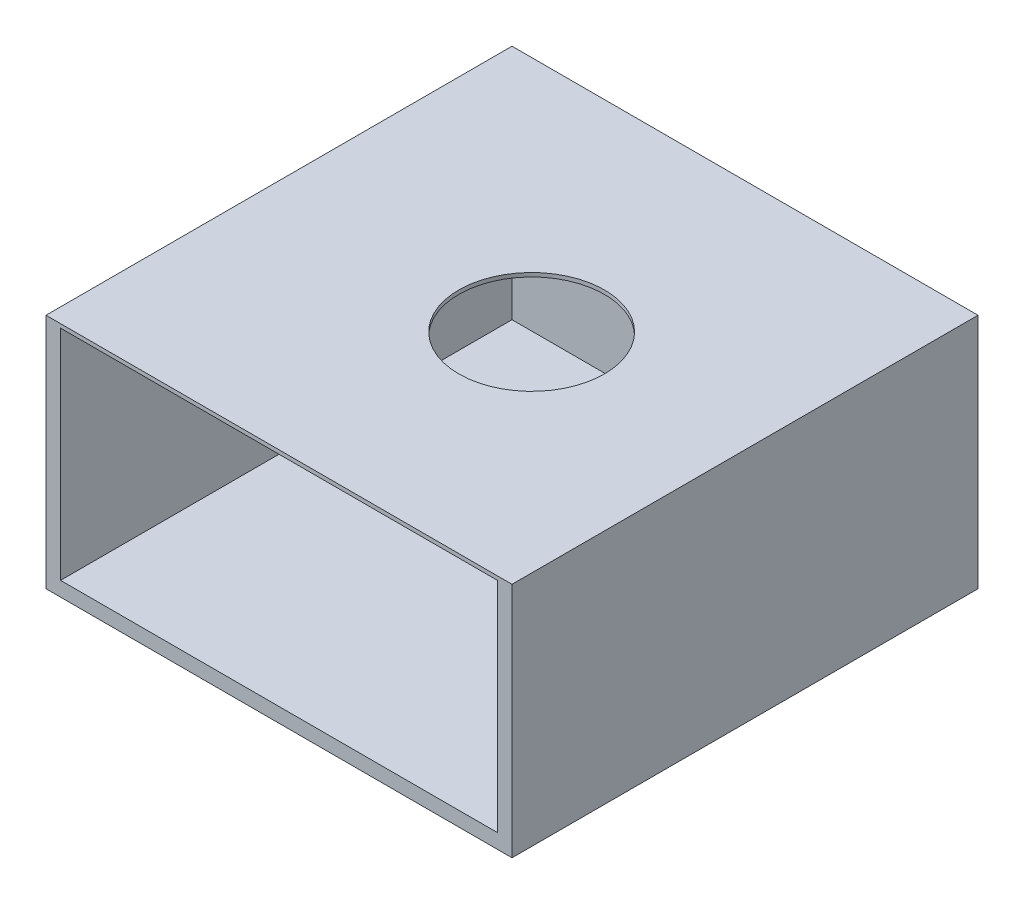
ISO-10303-21;
HEADER;
FILE_DESCRIPTION(('STEP AP214'),'2;1');
FILE_NAME('part.step','',(''),(''),'','','');
FILE_SCHEMA(('AUTOMOTIVE_DESIGN { 1 0 10303 214 1 1 1 1 }'));
ENDSEC;
DATA;
#1=APPLICATION_CONTEXT('core data for automotive mechanical design processes');
#2=APPLICATION_PROTOCOL_DEFINITION('international standard','automotive_design',2000,#1);
#3=PRODUCT_CONTEXT('',#1,'mechanical');
#4=PRODUCT('Part','Part','',(#3));
#5=PRODUCT_RELATED_PRODUCT_CATEGORY('part','',(#4));
#6=PRODUCT_DEFINITION_FORMATION('','',#4);
#7=PRODUCT_DEFINITION_CONTEXT('part definition',#1,'design');
#8=PRODUCT_DEFINITION('design','',#6,#7);
#9=PRODUCT_DEFINITION_SHAPE('','',#8);
#10=(LENGTH_UNIT() NAMED_UNIT(*) SI_UNIT(.MILLI.,.METRE.));
#11=(NAMED_UNIT(*) PLANE_ANGLE_UNIT() SI_UNIT($,.RADIAN.));
#12=(NAMED_UNIT(*) SI_UNIT($,.STERADIAN.) SOLID_ANGLE_UNIT());
#13=UNCERTAINTY_MEASURE_WITH_UNIT(LENGTH_MEASURE(1.E-05),#10,'distance_accuracy_value','');
#14=(GEOMETRIC_REPRESENTATION_CONTEXT(3) GLOBAL_UNCERTAINTY_ASSIGNED_CONTEXT((#13)) GLOBAL_UNIT_ASSIGNED_CONTEXT((#10,
#11,#12)) REPRESENTATION_CONTEXT('',''));
#15=CARTESIAN_POINT('',(0.,0.,0.));
#16=DIRECTION('',(0.,0.,1.));
#17=DIRECTION('',(1.,0.,0.));
#18=AXIS2_PLACEMENT_3D('',#15,#16,#17);
#19=CARTESIAN_POINT('',(0.,0.,304.8));
#20=DIRECTION('',(0.,0.,-1.));
#21=DIRECTION('',(-1.,0.,0.));
#22=AXIS2_PLACEMENT_3D('',#19,#20,#21);
#23=PLANE('',#22);
#24=DIRECTION('',(1.,0.,0.));
#25=VECTOR('',#24,1.);
#26=CARTESIAN_POINT('',(-152.4,78.74,304.8));
#27=LINE('',#26,#25);
#28=CARTESIAN_POINT('',(-152.4,78.74,304.8));
#29=VERTEX_POINT('',#28);
#30=CARTESIAN_POINT('',(152.4,78.74,304.8));
#31=VERTEX_POINT('',#30);
#32=EDGE_CURVE('E168',#29,#31,#27,.T.);
#33=ORIENTED_EDGE('',*,*,#32,.F.);
#34=DIRECTION('',(0.,-1.,0.));
#35=VECTOR('',#34,1.);
#36=CARTESIAN_POINT('',(-152.4,-76.2,304.8));
#37=LINE('',#36,#35);
#38=CARTESIAN_POINT('',(-152.4,-76.2,304.8));
#39=VERTEX_POINT('',#38);
#40=EDGE_CURVE('E117',#29,#39,#37,.T.);
#41=ORIENTED_EDGE('',*,*,#40,.T.);
#42=DIRECTION('',(1.,0.,0.));
#43=VECTOR('',#42,1.);
#44=CARTESIAN_POINT('',(-152.4,-76.2,304.8));
#45=LINE('',#44,#43);
#46=CARTESIAN_POINT('',(152.4,-76.2,304.8));
#47=VERTEX_POINT('',#46);
#48=EDGE_CURVE('E70',#39,#47,#45,.T.);
#49=ORIENTED_EDGE('',*,*,#48,.T.);
#50=DIRECTION('',(0.,1.,0.));
#51=VECTOR('',#50,1.);
#52=CARTESIAN_POINT('',(152.4,-76.2,304.8));
#53=LINE('',#52,#51);
#54=EDGE_CURVE('E91',#47,#31,#53,.T.);
#55=ORIENTED_EDGE('',*,*,#54,.T.);
#56=EDGE_LOOP('',(#33,#41,#49,#55));
#57=FACE_BOUND('',#56,.T.);
#58=DIRECTION('',(0.,1.,0.));
#59=VECTOR('',#58,1.);
#60=CARTESIAN_POINT('',(142.875,0.,304.8));
#61=LINE('',#60,#59);
#62=CARTESIAN_POINT('',(142.875,-66.675,304.8));
#63=VERTEX_POINT('',#62);
#64=CARTESIAN_POINT('',(142.875,76.2,304.8));
#65=VERTEX_POINT('',#64);
#66=EDGE_CURVE('E122',#63,#65,#61,.T.);
#67=ORIENTED_EDGE('',*,*,#66,.F.);
#68=DIRECTION('',(1.,0.,0.));
#69=VECTOR('',#68,1.);
#70=CARTESIAN_POINT('',(0.,-66.675,304.8));
#71=LINE('',#70,#69);
#72=CARTESIAN_POINT('',(-142.875,-66.675,304.8));
#73=VERTEX_POINT('',#72);
#74=EDGE_CURVE('E128',#73,#63,#71,.T.);
#75=ORIENTED_EDGE('',*,*,#74,.F.);
#76=DIRECTION('',(0.,-1.,0.));
#77=VECTOR('',#76,1.);
#78=CARTESIAN_POINT('',(-142.875,0.,304.8));
#79=LINE('',#78,#77);
#80=CARTESIAN_POINT('',(-142.875,76.2,304.8));
#81=VERTEX_POINT('',#80);
#82=EDGE_CURVE('E126',#81,#73,#79,.T.);
#83=ORIENTED_EDGE('',*,*,#82,.F.);
#84=DIRECTION('',(1.,0.,0.));
#85=VECTOR('',#84,1.);
#86=CARTESIAN_POINT('',(142.875,76.2,304.8));
#87=LINE('',#86,#85);
#88=EDGE_CURVE('E157',#81,#65,#87,.T.);
#89=ORIENTED_EDGE('',*,*,#88,.T.);
#90=EDGE_LOOP('',(#67,#75,#83,#89));
#91=FACE_BOUND('',#90,.T.);
#92=ADVANCED_FACE('F45',(#57,#91),#23,.F.);
#93=CARTESIAN_POINT('',(152.4,-76.2,304.8));
#94=DIRECTION('',(-1.,0.,0.));
#95=DIRECTION('',(0.,0.,1.));
#96=AXIS2_PLACEMENT_3D('',#93,#94,#95);
#97=PLANE('',#96);
#98=DIRECTION('',(0.,1.,0.));
#99=VECTOR('',#98,1.);
#100=CARTESIAN_POINT('',(152.4,-76.2,0.));
#101=LINE('',#100,#99);
#102=CARTESIAN_POINT('',(152.4,-76.2,0.));
#103=VERTEX_POINT('',#102);
#104=CARTESIAN_POINT('',(152.4,78.74,0.));
#105=VERTEX_POINT('',#104);
#106=EDGE_CURVE('E98',#103,#105,#101,.T.);
#107=ORIENTED_EDGE('',*,*,#106,.T.);
#108=DIRECTION('',(0.,0.,-1.));
#109=VECTOR('',#108,1.);
#110=CARTESIAN_POINT('',(152.4,78.74,304.8));
#111=LINE('',#110,#109);
#112=EDGE_CURVE('E165',#31,#105,#111,.T.);
#113=ORIENTED_EDGE('',*,*,#112,.F.);
#114=ORIENTED_EDGE('',*,*,#54,.F.);
#115=DIRECTION('',(0.,0.,-1.));
#116=VECTOR('',#115,1.);
#117=CARTESIAN_POINT('',(152.4,-76.2,304.8));
#118=LINE('',#117,#116);
#119=EDGE_CURVE('E54',#47,#103,#118,.T.);
#120=ORIENTED_EDGE('',*,*,#119,.T.);
#121=EDGE_LOOP('',(#107,#113,#114,#120));
#122=FACE_BOUND('',#121,.T.);
#123=ADVANCED_FACE('F47',(#122),#97,.F.);
#124=CARTESIAN_POINT('',(-152.4,-76.2,304.8));
#125=DIRECTION('',(1.,0.,0.));
#126=DIRECTION('',(0.,0.,-1.));
#127=AXIS2_PLACEMENT_3D('',#124,#125,#126);
#128=PLANE('',#127);
#129=DIRECTION('',(0.,-1.,0.));
#130=VECTOR('',#129,1.);
#131=CARTESIAN_POINT('',(-152.4,-76.2,0.));
#132=LINE('',#131,#130);
#133=CARTESIAN_POINT('',(-152.4,78.74,0.));
#134=VERTEX_POINT('',#133);
#135=CARTESIAN_POINT('',(-152.4,-76.2,0.));
#136=VERTEX_POINT('',#135);
#137=EDGE_CURVE('E92',#134,#136,#132,.T.);
#138=ORIENTED_EDGE('',*,*,#137,.T.);
#139=DIRECTION('',(0.,0.,-1.));
#140=VECTOR('',#139,1.);
#141=CARTESIAN_POINT('',(-152.4,-76.2,304.8));
#142=LINE('',#141,#140);
#143=EDGE_CURVE('E11',#39,#136,#142,.T.);
#144=ORIENTED_EDGE('',*,*,#143,.F.);
#145=ORIENTED_EDGE('',*,*,#40,.F.);
#146=DIRECTION('',(0.,0.,1.));
#147=VECTOR('',#146,1.);
#148=CARTESIAN_POINT('',(-152.4,78.74,0.));
#149=LINE('',#148,#147);
#150=EDGE_CURVE('E161',#134,#29,#149,.T.);
#151=ORIENTED_EDGE('',*,*,#150,.F.);
#152=EDGE_LOOP('',(#138,#144,#145,#151));
#153=FACE_BOUND('',#152,.T.);
#154=ADVANCED_FACE('F199',(#153),#128,.F.);
#155=CARTESIAN_POINT('',(-152.4,-76.2,304.8));
#156=DIRECTION('',(0.,1.,0.));
#157=DIRECTION('',(0.,0.,1.));
#158=AXIS2_PLACEMENT_3D('',#155,#156,#157);
#159=PLANE('',#158);
#160=DIRECTION('',(1.,0.,0.));
#161=VECTOR('',#160,1.);
#162=CARTESIAN_POINT('',(-152.4,-76.2,0.));
#163=LINE('',#162,#161);
#164=EDGE_CURVE('E82',#136,#103,#163,.T.);
#165=ORIENTED_EDGE('',*,*,#164,.T.);
#166=ORIENTED_EDGE('',*,*,#119,.F.);
#167=ORIENTED_EDGE('',*,*,#48,.F.);
#168=ORIENTED_EDGE('',*,*,#143,.T.);
#169=EDGE_LOOP('',(#165,#166,#167,#168));
#170=FACE_BOUND('',#169,.T.);
#171=ADVANCED_FACE('F84',(#170),#159,.F.);
#172=CARTESIAN_POINT('',(0.,0.,0.));
#173=DIRECTION('',(0.,0.,-1.));
#174=DIRECTION('',(-1.,0.,0.));
#175=AXIS2_PLACEMENT_3D('',#172,#173,#174);
#176=PLANE('',#175);
#177=ORIENTED_EDGE('',*,*,#106,.F.);
#178=ORIENTED_EDGE('',*,*,#164,.F.);
#179=ORIENTED_EDGE('',*,*,#137,.F.);
#180=DIRECTION('',(-1.,0.,0.));
#181=VECTOR('',#180,1.);
#182=CARTESIAN_POINT('',(152.4,78.74,0.));
#183=LINE('',#182,#181);
#184=EDGE_CURVE('E104',#105,#134,#183,.T.);
#185=ORIENTED_EDGE('',*,*,#184,.F.);
#186=EDGE_LOOP('',(#177,#178,#179,#185));
#187=FACE_BOUND('',#186,.T.);
#188=ADVANCED_FACE('F102',(#187),#176,.T.);
#189=CARTESIAN_POINT('',(142.875,-76.2,304.8));
#190=DIRECTION('',(-1.,0.,0.));
#191=DIRECTION('',(0.,0.,1.));
#192=AXIS2_PLACEMENT_3D('',#189,#190,#191);
#193=PLANE('',#192);
#194=DIRECTION('',(0.,1.,0.));
#195=VECTOR('',#194,1.);
#196=CARTESIAN_POINT('',(142.875,0.,9.525));
#197=LINE('',#196,#195);
#198=CARTESIAN_POINT('',(142.875,-66.675,9.525));
#199=VERTEX_POINT('',#198);
#200=CARTESIAN_POINT('',(142.875,76.2,9.525));
#201=VERTEX_POINT('',#200);
#202=EDGE_CURVE('E141',#199,#201,#197,.T.);
#203=ORIENTED_EDGE('',*,*,#202,.F.);
#204=DIRECTION('',(0.,0.,-1.));
#205=VECTOR('',#204,1.);
#206=CARTESIAN_POINT('',(142.875,-66.675,304.8));
#207=LINE('',#206,#205);
#208=EDGE_CURVE('E131',#63,#199,#207,.T.);
#209=ORIENTED_EDGE('',*,*,#208,.F.);
#210=ORIENTED_EDGE('',*,*,#66,.T.);
#211=DIRECTION('',(0.,0.,-1.));
#212=VECTOR('',#211,1.);
#213=CARTESIAN_POINT('',(142.875,76.2,304.8));
#214=LINE('',#213,#212);
#215=EDGE_CURVE('E106',#65,#201,#214,.T.);
#216=ORIENTED_EDGE('',*,*,#215,.T.);
#217=EDGE_LOOP('',(#203,#209,#210,#216));
#218=FACE_BOUND('',#217,.T.);
#219=ADVANCED_FACE('F226',(#218),#193,.T.);
#220=CARTESIAN_POINT('',(-142.875,-76.2,304.8));
#221=DIRECTION('',(1.,0.,0.));
#222=DIRECTION('',(0.,0.,-1.));
#223=AXIS2_PLACEMENT_3D('',#220,#221,#222);
#224=PLANE('',#223);
#225=DIRECTION('',(0.,-1.,0.));
#226=VECTOR('',#225,1.);
#227=CARTESIAN_POINT('',(-142.875,0.,9.525));
#228=LINE('',#227,#226);
#229=CARTESIAN_POINT('',(-142.875,76.2,9.525));
#230=VERTEX_POINT('',#229);
#231=CARTESIAN_POINT('',(-142.875,-66.675,9.525));
#232=VERTEX_POINT('',#231);
#233=EDGE_CURVE('E140',#230,#232,#228,.T.);
#234=ORIENTED_EDGE('',*,*,#233,.F.);
#235=DIRECTION('',(0.,0.,-1.));
#236=VECTOR('',#235,1.);
#237=CARTESIAN_POINT('',(-142.875,76.2,304.8));
#238=LINE('',#237,#236);
#239=EDGE_CURVE('E112',#81,#230,#238,.T.);
#240=ORIENTED_EDGE('',*,*,#239,.F.);
#241=ORIENTED_EDGE('',*,*,#82,.T.);
#242=DIRECTION('',(0.,0.,-1.));
#243=VECTOR('',#242,1.);
#244=CARTESIAN_POINT('',(-142.875,-66.675,304.8));
#245=LINE('',#244,#243);
#246=EDGE_CURVE('E61',#73,#232,#245,.T.);
#247=ORIENTED_EDGE('',*,*,#246,.T.);
#248=EDGE_LOOP('',(#234,#240,#241,#247));
#249=FACE_BOUND('',#248,.T.);
#250=ADVANCED_FACE('F231',(#249),#224,.T.);
#251=CARTESIAN_POINT('',(-152.4,-66.675,304.8));
#252=DIRECTION('',(0.,1.,0.));
#253=DIRECTION('',(0.,0.,1.));
#254=AXIS2_PLACEMENT_3D('',#251,#252,#253);
#255=PLANE('',#254);
#256=DIRECTION('',(1.,0.,0.));
#257=VECTOR('',#256,1.);
#258=CARTESIAN_POINT('',(0.,-66.675,9.525));
#259=LINE('',#258,#257);
#260=EDGE_CURVE('E127',#232,#199,#259,.T.);
#261=ORIENTED_EDGE('',*,*,#260,.F.);
#262=ORIENTED_EDGE('',*,*,#246,.F.);
#263=ORIENTED_EDGE('',*,*,#74,.T.);
#264=ORIENTED_EDGE('',*,*,#208,.T.);
#265=EDGE_LOOP('',(#261,#262,#263,#264));
#266=FACE_BOUND('',#265,.T.);
#267=ADVANCED_FACE('F220',(#266),#255,.T.);
#268=CARTESIAN_POINT('',(0.,0.,9.525));
#269=DIRECTION('',(0.,0.,-1.));
#270=DIRECTION('',(-1.,0.,0.));
#271=AXIS2_PLACEMENT_3D('',#268,#269,#270);
#272=PLANE('',#271);
#273=ORIENTED_EDGE('',*,*,#202,.T.);
#274=DIRECTION('',(-1.,0.,0.));
#275=VECTOR('',#274,1.);
#276=CARTESIAN_POINT('',(0.,76.2,9.525));
#277=LINE('',#276,#275);
#278=EDGE_CURVE('E137',#201,#230,#277,.T.);
#279=ORIENTED_EDGE('',*,*,#278,.T.);
#280=ORIENTED_EDGE('',*,*,#233,.T.);
#281=ORIENTED_EDGE('',*,*,#260,.T.);
#282=EDGE_LOOP('',(#273,#279,#280,#281));
#283=FACE_BOUND('',#282,.T.);
#284=ADVANCED_FACE('F233',(#283),#272,.F.);
#285=CARTESIAN_POINT('',(0.,76.2,0.));
#286=DIRECTION('',(0.,1.,0.));
#287=DIRECTION('',(0.,0.,1.));
#288=AXIS2_PLACEMENT_3D('',#285,#286,#287);
#289=PLANE('',#288);
#290=CARTESIAN_POINT('',(15.875,76.2,155.428881859153));
#291=DIRECTION('',(0.,1.,0.));
#292=DIRECTION('',(0.,0.,1.));
#293=AXIS2_PLACEMENT_3D('',#290,#291,#292);
#294=CIRCLE('',#293,47.625);
#295=CARTESIAN_POINT('',(15.875,76.2,203.053881859153));
#296=VERTEX_POINT('',#295);
#297=EDGE_CURVE('E162',#296,#296,#294,.T.);
#298=ORIENTED_EDGE('',*,*,#297,.T.);
#299=EDGE_LOOP('',(#298));
#300=FACE_BOUND('',#299,.T.);
#301=ORIENTED_EDGE('',*,*,#88,.F.);
#302=ORIENTED_EDGE('',*,*,#239,.T.);
#303=ORIENTED_EDGE('',*,*,#278,.F.);
#304=ORIENTED_EDGE('',*,*,#215,.F.);
#305=EDGE_LOOP('',(#301,#302,#303,#304));
#306=FACE_BOUND('',#305,.T.);
#307=ADVANCED_FACE('F189',(#300,#306),#289,.F.);
#308=CARTESIAN_POINT('',(0.,78.74,0.));
#309=DIRECTION('',(0.,1.,0.));
#310=DIRECTION('',(0.,0.,1.));
#311=AXIS2_PLACEMENT_3D('',#308,#309,#310);
#312=PLANE('',#311);
#313=CARTESIAN_POINT('',(15.875,78.74,155.428881859153));
#314=DIRECTION('',(0.,1.,0.));
#315=DIRECTION('',(0.,0.,1.));
#316=AXIS2_PLACEMENT_3D('',#313,#314,#315);
#317=CIRCLE('',#316,47.625);
#318=CARTESIAN_POINT('',(15.875,78.74,203.053881859153));
#319=VERTEX_POINT('',#318);
#320=EDGE_CURVE('E178',#319,#319,#317,.T.);
#321=ORIENTED_EDGE('',*,*,#320,.F.);
#322=EDGE_LOOP('',(#321));
#323=FACE_BOUND('',#322,.T.);
#324=ORIENTED_EDGE('',*,*,#150,.T.);
#325=ORIENTED_EDGE('',*,*,#32,.T.);
#326=ORIENTED_EDGE('',*,*,#112,.T.);
#327=ORIENTED_EDGE('',*,*,#184,.T.);
#328=EDGE_LOOP('',(#324,#325,#326,#327));
#329=FACE_BOUND('',#328,.T.);
#330=ADVANCED_FACE('F186',(#323,#329),#312,.T.);
#331=CARTESIAN_POINT('',(15.875,71.12,155.428881859153));
#332=DIRECTION('',(0.,1.,0.));
#333=DIRECTION('',(0.,0.,1.));
#334=AXIS2_PLACEMENT_3D('',#331,#332,#333);
#335=CYLINDRICAL_SURFACE('',#334,47.625);
#336=ORIENTED_EDGE('',*,*,#320,.T.);
#337=EDGE_LOOP('',(#336));
#338=FACE_BOUND('',#337,.T.);
#339=ORIENTED_EDGE('',*,*,#297,.F.);
#340=EDGE_LOOP('',(#339));
#341=FACE_BOUND('',#340,.T.);
#342=ADVANCED_FACE('F183',(#338,#341),#335,.F.);
#343=CLOSED_SHELL('',(#92,#123,#154,#171,#188,#219,#250,#267,#284,#307,#330,#342));
#344=MANIFOLD_SOLID_BREP('B2',#343);
#345=ADVANCED_BREP_SHAPE_REPRESENTATION('',(#18,#344),#14);
#346=SHAPE_DEFINITION_REPRESENTATION(#9,#345);
ENDSEC;
END-ISO-10303-21;
